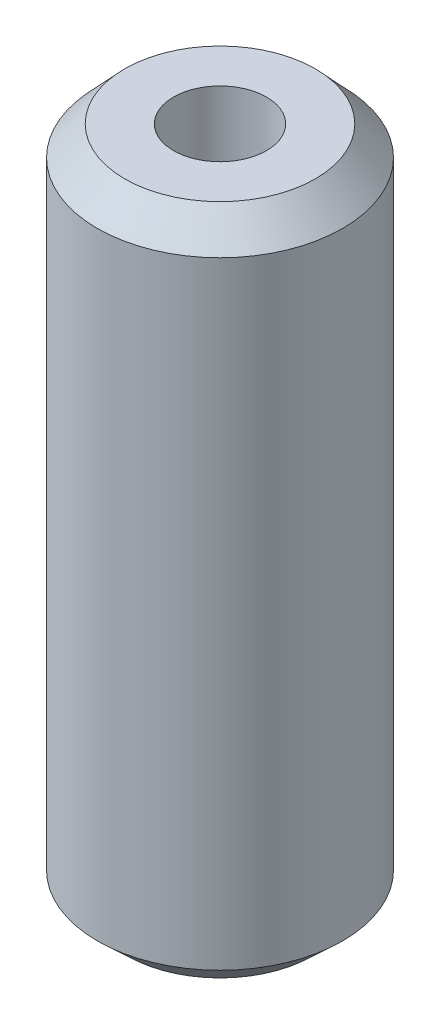
ISO-10303-21;
HEADER;
FILE_DESCRIPTION(('STEP AP214'),'2;1');
FILE_NAME('part.step','',(''),(''),'','','');
FILE_SCHEMA(('AUTOMOTIVE_DESIGN { 1 0 10303 214 1 1 1 1 }'));
ENDSEC;
DATA;
#1=APPLICATION_CONTEXT('core data for automotive mechanical design processes');
#2=APPLICATION_PROTOCOL_DEFINITION('international standard','automotive_design',2000,#1);
#3=PRODUCT_CONTEXT('',#1,'mechanical');
#4=PRODUCT('Part','Part','',(#3));
#5=PRODUCT_RELATED_PRODUCT_CATEGORY('part','',(#4));
#6=PRODUCT_DEFINITION_FORMATION('','',#4);
#7=PRODUCT_DEFINITION_CONTEXT('part definition',#1,'design');
#8=PRODUCT_DEFINITION('design','',#6,#7);
#9=PRODUCT_DEFINITION_SHAPE('','',#8);
#10=(LENGTH_UNIT() NAMED_UNIT(*) SI_UNIT(.MILLI.,.METRE.));
#11=(NAMED_UNIT(*) PLANE_ANGLE_UNIT() SI_UNIT($,.RADIAN.));
#12=(NAMED_UNIT(*) SI_UNIT($,.STERADIAN.) SOLID_ANGLE_UNIT());
#13=UNCERTAINTY_MEASURE_WITH_UNIT(LENGTH_MEASURE(1.E-05),#10,'distance_accuracy_value','');
#14=(GEOMETRIC_REPRESENTATION_CONTEXT(3) GLOBAL_UNCERTAINTY_ASSIGNED_CONTEXT((#13)) GLOBAL_UNIT_ASSIGNED_CONTEXT((#10,
#11,#12)) REPRESENTATION_CONTEXT('',''));
#15=CARTESIAN_POINT('',(0.,0.,0.));
#16=DIRECTION('',(0.,0.,1.));
#17=DIRECTION('',(1.,0.,0.));
#18=AXIS2_PLACEMENT_3D('',#15,#16,#17);
#19=CARTESIAN_POINT('',(0.,27.4567361025218,0.));
#20=DIRECTION('',(0.,-1.,0.));
#21=DIRECTION('',(0.,0.,-1.));
#22=AXIS2_PLACEMENT_3D('',#19,#20,#21);
#23=CYLINDRICAL_SURFACE('',#22,5.);
#24=CARTESIAN_POINT('',(0.,26.2644789631266,0.));
#25=DIRECTION('',(0.,1.,0.));
#26=DIRECTION('',(0.,0.,1.));
#27=AXIS2_PLACEMENT_3D('',#24,#25,#26);
#28=CIRCLE('',#27,5.);
#29=CARTESIAN_POINT('',(0.,26.2644789631266,-5.));
#30=VERTEX_POINT('',#29);
#31=EDGE_CURVE('E50',#30,#30,#28,.F.);
#32=CARTESIAN_POINT('',(0.,1.11461752447149,0.));
#33=DIRECTION('',(0.,1.,0.));
#34=DIRECTION('',(0.,0.,1.));
#35=AXIS2_PLACEMENT_3D('',#32,#33,#34);
#36=CIRCLE('',#35,5.);
#37=CARTESIAN_POINT('',(0.,1.11461752447149,-5.));
#38=VERTEX_POINT('',#37);
#39=EDGE_CURVE('E51',#38,#38,#36,.T.);
#40=CARTESIAN_POINT('',(0.,26.2644789631266,-5.));
#41=CARTESIAN_POINT('',(0.,26.0025012398073,-5.));
#42=CARTESIAN_POINT('',(0.,25.7405235164879,-5.));
#43=CARTESIAN_POINT('',(0.,25.2165680698493,-5.));
#44=CARTESIAN_POINT('',(0.,24.95459034653,-5.));
#45=CARTESIAN_POINT('',(0.,24.4306348998913,-5.));
#46=CARTESIAN_POINT('',(0.,24.168657176572,-5.));
#47=CARTESIAN_POINT('',(0.,23.6447017299333,-5.));
#48=CARTESIAN_POINT('',(0.,23.382724006614,-5.));
#49=CARTESIAN_POINT('',(0.,22.8587685599754,-5.));
#50=CARTESIAN_POINT('',(0.,22.596790836656,-5.));
#51=CARTESIAN_POINT('',(0.,22.0728353900174,-5.));
#52=CARTESIAN_POINT('',(0.,21.8108576666981,-5.));
#53=CARTESIAN_POINT('',(0.,21.2869022200594,-5.));
#54=CARTESIAN_POINT('',(0.,21.0249244967401,-5.));
#55=CARTESIAN_POINT('',(0.,20.5009690501015,-5.));
#56=CARTESIAN_POINT('',(0.,20.2389913267821,-5.));
#57=CARTESIAN_POINT('',(0.,19.7150358801435,-5.));
#58=CARTESIAN_POINT('',(0.,19.4530581568242,-5.));
#59=CARTESIAN_POINT('',(0.,18.9291027101855,-5.));
#60=CARTESIAN_POINT('',(0.,18.6671249868662,-5.));
#61=CARTESIAN_POINT('',(0.,18.1431695402275,-5.));
#62=CARTESIAN_POINT('',(0.,17.8811918169082,-5.));
#63=CARTESIAN_POINT('',(0.,17.3572363702696,-5.));
#64=CARTESIAN_POINT('',(0.,17.0952586469502,-5.));
#65=CARTESIAN_POINT('',(0.,16.5713032003116,-5.));
#66=CARTESIAN_POINT('',(0.,16.3093254769923,-5.));
#67=CARTESIAN_POINT('',(0.,15.7853700303536,-5.));
#68=CARTESIAN_POINT('',(0.,15.5233923070343,-5.));
#69=CARTESIAN_POINT('',(0.,14.9994368603957,-5.));
#70=CARTESIAN_POINT('',(0.,14.7374591370763,-5.));
#71=CARTESIAN_POINT('',(0.,14.2135036904377,-5.));
#72=CARTESIAN_POINT('',(0.,13.9515259671184,-5.));
#73=CARTESIAN_POINT('',(0.,13.4275705204797,-5.));
#74=CARTESIAN_POINT('',(0.,13.1655927971604,-5.));
#75=CARTESIAN_POINT('',(0.,12.6416373505217,-5.));
#76=CARTESIAN_POINT('',(0.,12.3796596272024,-5.));
#77=CARTESIAN_POINT('',(0.,11.8557041805638,-5.));
#78=CARTESIAN_POINT('',(0.,11.5937264572444,-5.));
#79=CARTESIAN_POINT('',(0.,11.0697710106058,-5.));
#80=CARTESIAN_POINT('',(0.,10.8077932872865,-5.));
#81=CARTESIAN_POINT('',(0.,10.2838378406478,-5.));
#82=CARTESIAN_POINT('',(0.,10.0218601173285,-5.));
#83=CARTESIAN_POINT('',(0.,9.49790467068985,-5.));
#84=CARTESIAN_POINT('',(0.,9.23592694737053,-5.));
#85=CARTESIAN_POINT('',(0.,8.71197150073188,-5.));
#86=CARTESIAN_POINT('',(0.,8.44999377741255,-5.));
#87=CARTESIAN_POINT('',(0.,7.92603833077391,-5.));
#88=CARTESIAN_POINT('',(0.,7.66406060745458,-5.));
#89=CARTESIAN_POINT('',(0.,7.14010516081594,-5.));
#90=CARTESIAN_POINT('',(0.,6.87812743749661,-5.));
#91=CARTESIAN_POINT('',(0.,6.35417199085796,-5.));
#92=CARTESIAN_POINT('',(0.,6.09219426753864,-5.));
#93=CARTESIAN_POINT('',(0.,5.56823882089999,-5.));
#94=CARTESIAN_POINT('',(0.,5.30626109758067,-5.));
#95=CARTESIAN_POINT('',(0.,4.78230565094202,-5.));
#96=CARTESIAN_POINT('',(0.,4.5203279276227,-5.));
#97=CARTESIAN_POINT('',(0.,3.99637248098405,-5.));
#98=CARTESIAN_POINT('',(0.,3.73439475766472,-5.));
#99=CARTESIAN_POINT('',(0.,3.21043931102608,-5.));
#100=CARTESIAN_POINT('',(0.,2.94846158770675,-5.));
#101=CARTESIAN_POINT('',(0.,2.4245061410681,-5.));
#102=CARTESIAN_POINT('',(0.,2.16252841774878,-5.));
#103=CARTESIAN_POINT('',(0.,1.63857297111013,-5.));
#104=CARTESIAN_POINT('',(0.,1.37659524779081,-5.));
#105=CARTESIAN_POINT('',(0.,1.11461752447149,-5.));
#106=B_SPLINE_CURVE_WITH_KNOTS('',3,(#40,#41,#42,#43,#44,#45,#46,#47,#48,#49,#50,#51,#52,#53,
#54,#55,#56,#57,#58,#59,#60,#61,#62,#63,#64,#65,#66,#67,#68,#69,#70,#71,#72,#73,#74,#75,#76,#77,
#78,#79,#80,#81,#82,#83,#84,#85,#86,#87,#88,#89,#90,#91,#92,#93,#94,#95,#96,#97,#98,#99,#100,
#101,#102,#103,#104,#105),.UNSPECIFIED.,.F.,.F.,(4,2,2,2,2,2,2,2,2,2,2,2,2,2,2,2,2,2,2,2,2,2,2,
2,2,2,2,2,2,2,2,2,4),(0.,0.785933169957974,1.57186633991594,2.35779950987392,3.14373267983189,
3.92966584978986,4.71559901974783,5.5015321897058,6.28746535966378,7.07339852962175,
7.85933169957972,8.64526486953769,9.43119803949566,10.2171312094536,11.0030643794116,
11.7889975493696,12.5749307193276,13.3608638892855,14.1467970592435,14.9327302292015,
15.7186633991594,16.5045965691174,17.2905297390754,18.0764629090334,18.8623960789913,
19.6483292489493,20.4342624189073,21.2201955888652,22.0061287588232,22.7920619287812,
23.5779950987392,24.3639282686971,25.1498614386551),.UNSPECIFIED.);
#107=EDGE_CURVE('BSEAM39',#30,#38,#106,.T.);
#108=ORIENTED_EDGE('',*,*,#31,.T.);
#109=ORIENTED_EDGE('',*,*,#39,.T.);
#110=ORIENTED_EDGE('',*,*,#107,.T.);
#111=ORIENTED_EDGE('',*,*,#107,.F.);
#112=EDGE_LOOP('',(#108,#110,#109,#111));
#113=FACE_BOUND('',#112,.T.);
#114=ADVANCED_FACE('F39',(#113),#23,.T.);
#115=CARTESIAN_POINT('',(0.,27.4567361025218,0.));
#116=DIRECTION('',(0.,1.,0.));
#117=DIRECTION('',(0.,0.,1.));
#118=AXIS2_PLACEMENT_3D('',#115,#116,#117);
#119=PLANE('',#118);
#120=CARTESIAN_POINT('',(0.,27.4567361025218,0.));
#121=DIRECTION('',(0.,1.,0.));
#122=DIRECTION('',(0.,0.,1.));
#123=AXIS2_PLACEMENT_3D('',#120,#121,#122);
#124=CIRCLE('',#123,3.88538247552855);
#125=CARTESIAN_POINT('',(0.,27.4567361025218,3.88538247552855));
#126=VERTEX_POINT('',#125);
#127=EDGE_CURVE('E54',#126,#126,#124,.T.);
#128=ORIENTED_EDGE('',*,*,#127,.T.);
#129=EDGE_LOOP('',(#128));
#130=FACE_BOUND('',#129,.T.);
#131=CARTESIAN_POINT('',(0.,27.4567361025218,0.));
#132=DIRECTION('',(0.,1.,0.));
#133=DIRECTION('',(0.,0.,1.));
#134=AXIS2_PLACEMENT_3D('',#131,#132,#133);
#135=CIRCLE('',#134,1.89405253629672);
#136=CARTESIAN_POINT('',(0.,27.4567361025218,-1.89405253629672));
#137=VERTEX_POINT('',#136);
#138=EDGE_CURVE('E58',#137,#137,#135,.T.);
#139=ORIENTED_EDGE('',*,*,#138,.F.);
#140=EDGE_LOOP('',(#139));
#141=FACE_BOUND('',#140,.T.);
#142=ADVANCED_FACE('F69',(#130,#141),#119,.T.);
#143=CARTESIAN_POINT('',(0.,0.,0.));
#144=DIRECTION('',(0.,1.,0.));
#145=DIRECTION('',(0.,0.,1.));
#146=AXIS2_PLACEMENT_3D('',#143,#144,#145);
#147=PLANE('',#146);
#148=CARTESIAN_POINT('',(0.,0.,0.));
#149=DIRECTION('',(0.,1.,0.));
#150=DIRECTION('',(0.,0.,1.));
#151=AXIS2_PLACEMENT_3D('',#148,#149,#150);
#152=CIRCLE('',#151,3.80774286060475);
#153=CARTESIAN_POINT('',(0.,0.,3.80774286060475));
#154=VERTEX_POINT('',#153);
#155=EDGE_CURVE('E10',#154,#154,#152,.F.);
#156=ORIENTED_EDGE('',*,*,#155,.T.);
#157=EDGE_LOOP('',(#156));
#158=FACE_BOUND('',#157,.T.);
#159=CARTESIAN_POINT('',(0.,0.,0.));
#160=DIRECTION('',(0.,1.,0.));
#161=DIRECTION('',(0.,0.,1.));
#162=AXIS2_PLACEMENT_3D('',#159,#160,#161);
#163=CIRCLE('',#162,1.89405253629672);
#164=CARTESIAN_POINT('',(0.,0.,-1.89405253629672));
#165=VERTEX_POINT('',#164);
#166=EDGE_CURVE('E63',#165,#165,#163,.T.);
#167=ORIENTED_EDGE('',*,*,#166,.T.);
#168=EDGE_LOOP('',(#167));
#169=FACE_BOUND('',#168,.T.);
#170=ADVANCED_FACE('F75',(#158,#169),#147,.F.);
#171=CARTESIAN_POINT('',(0.,27.4567361025218,0.));
#172=DIRECTION('',(0.,-1.,0.));
#173=DIRECTION('',(0.,0.,-1.));
#174=AXIS2_PLACEMENT_3D('',#171,#172,#173);
#175=CYLINDRICAL_SURFACE('',#174,1.89405253629672);
#176=CARTESIAN_POINT('',(0.,27.4567361025218,-1.89405253629672));
#177=CARTESIAN_POINT('',(0.,27.1707284347872,-1.89405253629672));
#178=CARTESIAN_POINT('',(0.,26.8847207670526,-1.89405253629672));
#179=CARTESIAN_POINT('',(0.,26.3127054315834,-1.89405253629672));
#180=CARTESIAN_POINT('',(0.,26.0266977638488,-1.89405253629672));
#181=CARTESIAN_POINT('',(0.,25.4546824283796,-1.89405253629672));
#182=CARTESIAN_POINT('',(0.,25.168674760645,-1.89405253629672));
#183=CARTESIAN_POINT('',(0.,24.5966594251758,-1.89405253629672));
#184=CARTESIAN_POINT('',(0.,24.3106517574412,-1.89405253629672));
#185=CARTESIAN_POINT('',(0.,23.738636421972,-1.89405253629672));
#186=CARTESIAN_POINT('',(0.,23.4526287542374,-1.89405253629672));
#187=CARTESIAN_POINT('',(0.,22.8806134187682,-1.89405253629672));
#188=CARTESIAN_POINT('',(0.,22.5946057510336,-1.89405253629672));
#189=CARTESIAN_POINT('',(0.,22.0225904155644,-1.89405253629672));
#190=CARTESIAN_POINT('',(0.,21.7365827478298,-1.89405253629672));
#191=CARTESIAN_POINT('',(0.,21.1645674123606,-1.89405253629672));
#192=CARTESIAN_POINT('',(0.,20.878559744626,-1.89405253629672));
#193=CARTESIAN_POINT('',(0.,20.3065444091567,-1.89405253629672));
#194=CARTESIAN_POINT('',(0.,20.0205367414221,-1.89405253629672));
#195=CARTESIAN_POINT('',(0.,19.4485214059529,-1.89405253629672));
#196=CARTESIAN_POINT('',(0.,19.1625137382183,-1.89405253629672));
#197=CARTESIAN_POINT('',(0.,18.5904984027491,-1.89405253629672));
#198=CARTESIAN_POINT('',(0.,18.3044907350145,-1.89405253629672));
#199=CARTESIAN_POINT('',(0.,17.7324753995453,-1.89405253629672));
#200=CARTESIAN_POINT('',(0.,17.4464677318107,-1.89405253629672));
#201=CARTESIAN_POINT('',(0.,16.8744523963415,-1.89405253629672));
#202=CARTESIAN_POINT('',(0.,16.5884447286069,-1.89405253629672));
#203=CARTESIAN_POINT('',(0.,16.0164293931377,-1.89405253629672));
#204=CARTESIAN_POINT('',(0.,15.7304217254031,-1.89405253629672));
#205=CARTESIAN_POINT('',(0.,15.1584063899339,-1.89405253629672));
#206=CARTESIAN_POINT('',(0.,14.8723987221993,-1.89405253629672));
#207=CARTESIAN_POINT('',(0.,14.3003833867301,-1.89405253629672));
#208=CARTESIAN_POINT('',(0.,14.0143757189955,-1.89405253629672));
#209=CARTESIAN_POINT('',(0.,13.4423603835263,-1.89405253629672));
#210=CARTESIAN_POINT('',(0.,13.1563527157917,-1.89405253629672));
#211=CARTESIAN_POINT('',(0.,12.5843373803225,-1.89405253629672));
#212=CARTESIAN_POINT('',(0.,12.2983297125879,-1.89405253629672));
#213=CARTESIAN_POINT('',(0.,11.7263143771187,-1.89405253629672));
#214=CARTESIAN_POINT('',(0.,11.4403067093841,-1.89405253629672));
#215=CARTESIAN_POINT('',(0.,10.8682913739149,-1.89405253629672));
#216=CARTESIAN_POINT('',(0.,10.5822837061803,-1.89405253629672));
#217=CARTESIAN_POINT('',(0.,10.0102683707111,-1.89405253629672));
#218=CARTESIAN_POINT('',(0.,9.72426070297647,-1.89405253629672));
#219=CARTESIAN_POINT('',(0.,9.15224536750727,-1.89405253629672));
#220=CARTESIAN_POINT('',(0.,8.86623769977267,-1.89405253629672));
#221=CARTESIAN_POINT('',(0.,8.29422236430346,-1.89405253629672));
#222=CARTESIAN_POINT('',(0.,8.00821469656886,-1.89405253629672));
#223=CARTESIAN_POINT('',(0.,7.43619936109965,-1.89405253629672));
#224=CARTESIAN_POINT('',(0.,7.15019169336505,-1.89405253629672));
#225=CARTESIAN_POINT('',(0.,6.57817635789585,-1.89405253629672));
#226=CARTESIAN_POINT('',(0.,6.29216869016125,-1.89405253629672));
#227=CARTESIAN_POINT('',(0.,5.72015335469204,-1.89405253629672));
#228=CARTESIAN_POINT('',(0.,5.43414568695744,-1.89405253629672));
#229=CARTESIAN_POINT('',(0.,4.86213035148824,-1.89405253629672));
#230=CARTESIAN_POINT('',(0.,4.57612268375363,-1.89405253629672));
#231=CARTESIAN_POINT('',(0.,4.00410734828443,-1.89405253629672));
#232=CARTESIAN_POINT('',(0.,3.71809968054983,-1.89405253629672));
#233=CARTESIAN_POINT('',(0.,3.14608434508062,-1.89405253629672));
#234=CARTESIAN_POINT('',(0.,2.86007667734602,-1.89405253629672));
#235=CARTESIAN_POINT('',(0.,2.28806134187682,-1.89405253629672));
#236=CARTESIAN_POINT('',(0.,2.00205367414222,-1.89405253629672));
#237=CARTESIAN_POINT('',(0.,1.43003833867301,-1.89405253629672));
#238=CARTESIAN_POINT('',(0.,1.14403067093841,-1.89405253629672));
#239=CARTESIAN_POINT('',(0.,0.572015335469203,-1.89405253629672));
#240=CARTESIAN_POINT('',(0.,0.286007667734602,-1.89405253629672));
#241=CARTESIAN_POINT('',(0.,0.,-1.89405253629672));
#242=B_SPLINE_CURVE_WITH_KNOTS('',3,(#176,#177,#178,#179,#180,#181,#182,#183,#184,#185,#186,
#187,#188,#189,#190,#191,#192,#193,#194,#195,#196,#197,#198,#199,#200,#201,#202,#203,#204,#205,
#206,#207,#208,#209,#210,#211,#212,#213,#214,#215,#216,#217,#218,#219,#220,#221,#222,#223,#224,
#225,#226,#227,#228,#229,#230,#231,#232,#233,#234,#235,#236,#237,#238,#239,#240,#241),
.UNSPECIFIED.,.F.,.F.,(4,2,2,2,2,2,2,2,2,2,2,2,2,2,2,2,2,2,2,2,2,2,2,2,2,2,2,2,2,2,2,2,4),(0.,
0.858023003203808,1.71604600640761,2.57406900961142,3.43209201281523,4.29011501601903,
5.14813801922284,6.00616102242665,6.86418402563045,7.72220702883426,8.58023003203806,
9.43825303524187,10.2962760384457,11.1542990416495,12.0123220448533,12.8703450480571,
13.7283680512609,14.5863910544647,15.4444140576685,16.3024370608723,17.1604600640761,
18.0184830672799,18.8765060704837,19.7345290736875,20.5925520768914,21.4505750800952,
22.308598083299,23.1666210865028,24.0246440897066,24.8826670929104,25.7406900961142,
26.598713099318,27.4567361025218),.UNSPECIFIED.);
#243=EDGE_CURVE('BSEAM70',#137,#165,#242,.T.);
#244=ORIENTED_EDGE('',*,*,#138,.T.);
#245=ORIENTED_EDGE('',*,*,#166,.F.);
#246=ORIENTED_EDGE('',*,*,#243,.T.);
#247=ORIENTED_EDGE('',*,*,#243,.F.);
#248=EDGE_LOOP('',(#244,#246,#245,#247));
#249=FACE_BOUND('',#248,.T.);
#250=ADVANCED_FACE('F70',(#249),#175,.F.);
#251=CARTESIAN_POINT('',(0.,27.4567361025218,0.));
#252=DIRECTION('',(0.,-1.,0.));
#253=DIRECTION('',(0.,0.,-1.));
#254=AXIS2_PLACEMENT_3D('',#251,#252,#253);
#255=CONICAL_SURFACE('',#254,3.88538247552855,0.751755104389569);
#256=ORIENTED_EDGE('',*,*,#31,.F.);
#257=EDGE_LOOP('',(#256));
#258=FACE_BOUND('',#257,.T.);
#259=ORIENTED_EDGE('',*,*,#127,.F.);
#260=EDGE_LOOP('',(#259));
#261=FACE_BOUND('',#260,.T.);
#262=ADVANCED_FACE('F81',(#258,#261),#255,.T.);
#263=CARTESIAN_POINT('',(0.,1.11461752447149,0.));
#264=DIRECTION('',(0.,1.,0.));
#265=DIRECTION('',(0.,0.,1.));
#266=AXIS2_PLACEMENT_3D('',#263,#264,#265);
#267=CONICAL_SURFACE('',#266,5.,0.819041222405327);
#268=ORIENTED_EDGE('',*,*,#155,.F.);
#269=EDGE_LOOP('',(#268));
#270=FACE_BOUND('',#269,.T.);
#271=ORIENTED_EDGE('',*,*,#39,.F.);
#272=EDGE_LOOP('',(#271));
#273=FACE_BOUND('',#272,.T.);
#274=ADVANCED_FACE('F45',(#270,#273),#267,.T.);
#275=CLOSED_SHELL('',(#114,#142,#170,#250,#262,#274));
#276=MANIFOLD_SOLID_BREP('B2',#275);
#277=ADVANCED_BREP_SHAPE_REPRESENTATION('',(#18,#276),#14);
#278=SHAPE_DEFINITION_REPRESENTATION(#9,#277);
ENDSEC;
END-ISO-10303-21;
